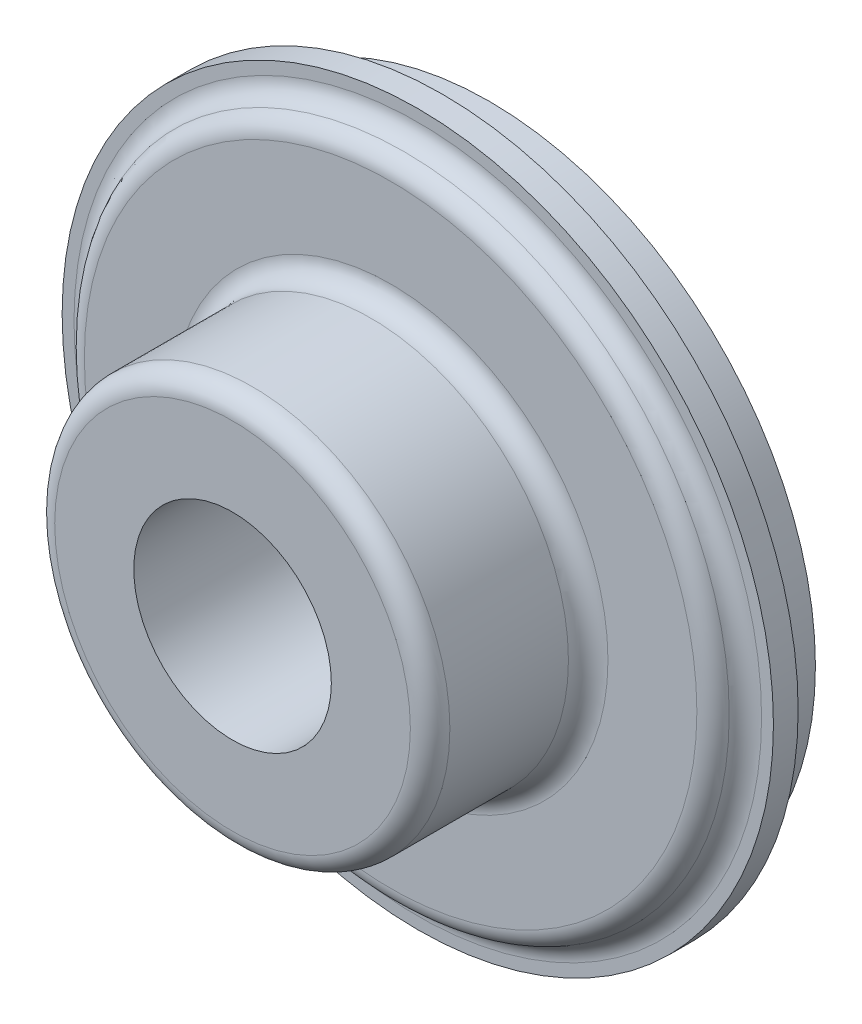
ISO-10303-21;
HEADER;
FILE_DESCRIPTION(('STEP AP214'),'2;1');
FILE_NAME('part.step','',(''),(''),'','','');
FILE_SCHEMA(('AUTOMOTIVE_DESIGN { 1 0 10303 214 1 1 1 1 }'));
ENDSEC;
DATA;
#1=APPLICATION_CONTEXT('core data for automotive mechanical design processes');
#2=APPLICATION_PROTOCOL_DEFINITION('international standard','automotive_design',2000,#1);
#3=PRODUCT_CONTEXT('',#1,'mechanical');
#4=PRODUCT('Part','Part','',(#3));
#5=PRODUCT_RELATED_PRODUCT_CATEGORY('part','',(#4));
#6=PRODUCT_DEFINITION_FORMATION('','',#4);
#7=PRODUCT_DEFINITION_CONTEXT('part definition',#1,'design');
#8=PRODUCT_DEFINITION('design','',#6,#7);
#9=PRODUCT_DEFINITION_SHAPE('','',#8);
#10=(LENGTH_UNIT() NAMED_UNIT(*) SI_UNIT(.MILLI.,.METRE.));
#11=(NAMED_UNIT(*) PLANE_ANGLE_UNIT() SI_UNIT($,.RADIAN.));
#12=(NAMED_UNIT(*) SI_UNIT($,.STERADIAN.) SOLID_ANGLE_UNIT());
#13=UNCERTAINTY_MEASURE_WITH_UNIT(LENGTH_MEASURE(1.E-05),#10,'distance_accuracy_value','');
#14=(GEOMETRIC_REPRESENTATION_CONTEXT(3) GLOBAL_UNCERTAINTY_ASSIGNED_CONTEXT((#13)) GLOBAL_UNIT_ASSIGNED_CONTEXT((#10,
#11,#12)) REPRESENTATION_CONTEXT('',''));
#15=CARTESIAN_POINT('',(0.,0.,0.));
#16=DIRECTION('',(0.,0.,1.));
#17=DIRECTION('',(1.,0.,0.));
#18=AXIS2_PLACEMENT_3D('',#15,#16,#17);
#19=CARTESIAN_POINT('',(0.,0.,229.));
#20=DIRECTION('',(0.,0.,1.));
#21=DIRECTION('',(1.,0.,0.));
#22=AXIS2_PLACEMENT_3D('',#19,#20,#21);
#23=TOROIDAL_SURFACE('',#22,22.,2.);
#24=CARTESIAN_POINT('',(0.,0.,227.));
#25=DIRECTION('',(0.,0.,1.));
#26=DIRECTION('',(1.,0.,0.));
#27=AXIS2_PLACEMENT_3D('',#24,#25,#26);
#28=CIRCLE('',#27,22.);
#29=CARTESIAN_POINT('',(22.,0.,227.));
#30=VERTEX_POINT('',#29);
#31=EDGE_CURVE('E128',#30,#30,#28,.T.);
#32=ORIENTED_EDGE('',*,*,#31,.T.);
#33=EDGE_LOOP('',(#32));
#34=FACE_BOUND('',#33,.T.);
#35=CARTESIAN_POINT('',(0.,0.,229.));
#36=DIRECTION('',(0.,0.,1.));
#37=DIRECTION('',(1.,0.,0.));
#38=AXIS2_PLACEMENT_3D('',#35,#36,#37);
#39=CIRCLE('',#38,20.);
#40=CARTESIAN_POINT('',(20.,0.,229.));
#41=VERTEX_POINT('',#40);
#42=EDGE_CURVE('E10',#41,#41,#39,.T.);
#43=ORIENTED_EDGE('',*,*,#42,.F.);
#44=EDGE_LOOP('',(#43));
#45=FACE_BOUND('',#44,.T.);
#46=ADVANCED_FACE('F41',(#34,#45),#23,.F.);
#47=CARTESIAN_POINT('',(0.,0.,208.));
#48=DIRECTION('',(0.,0.,1.));
#49=DIRECTION('',(1.,0.,0.));
#50=AXIS2_PLACEMENT_3D('',#47,#48,#49);
#51=CYLINDRICAL_SURFACE('',#50,20.);
#52=ORIENTED_EDGE('',*,*,#42,.T.);
#53=EDGE_LOOP('',(#52));
#54=FACE_BOUND('',#53,.T.);
#55=CARTESIAN_POINT('',(0.,0.,241.));
#56=DIRECTION('',(0.,0.,1.));
#57=DIRECTION('',(1.,0.,0.));
#58=AXIS2_PLACEMENT_3D('',#55,#56,#57);
#59=CIRCLE('',#58,20.);
#60=CARTESIAN_POINT('',(20.,0.,241.));
#61=VERTEX_POINT('',#60);
#62=EDGE_CURVE('E48',#61,#61,#59,.T.);
#63=ORIENTED_EDGE('',*,*,#62,.F.);
#64=EDGE_LOOP('',(#63));
#65=FACE_BOUND('',#64,.T.);
#66=ADVANCED_FACE('F147',(#54,#65),#51,.T.);
#67=CARTESIAN_POINT('',(0.,0.,241.));
#68=DIRECTION('',(0.,0.,1.));
#69=DIRECTION('',(1.,0.,0.));
#70=AXIS2_PLACEMENT_3D('',#67,#68,#69);
#71=TOROIDAL_SURFACE('',#70,18.,2.);
#72=ORIENTED_EDGE('',*,*,#62,.T.);
#73=EDGE_LOOP('',(#72));
#74=FACE_BOUND('',#73,.T.);
#75=CARTESIAN_POINT('',(0.,0.,243.));
#76=DIRECTION('',(0.,0.,1.));
#77=DIRECTION('',(1.,0.,0.));
#78=AXIS2_PLACEMENT_3D('',#75,#76,#77);
#79=CIRCLE('',#78,18.);
#80=CARTESIAN_POINT('',(18.,0.,243.));
#81=VERTEX_POINT('',#80);
#82=EDGE_CURVE('E53',#81,#81,#79,.T.);
#83=ORIENTED_EDGE('',*,*,#82,.F.);
#84=EDGE_LOOP('',(#83));
#85=FACE_BOUND('',#84,.T.);
#86=ADVANCED_FACE('F151',(#74,#85),#71,.T.);
#87=CARTESIAN_POINT('',(10.,0.,243.));
#88=DIRECTION('',(0.,0.,1.));
#89=DIRECTION('',(1.,0.,0.));
#90=AXIS2_PLACEMENT_3D('',#87,#88,#89);
#91=PLANE('',#90);
#92=ORIENTED_EDGE('',*,*,#82,.T.);
#93=EDGE_LOOP('',(#92));
#94=FACE_BOUND('',#93,.T.);
#95=CARTESIAN_POINT('',(0.,0.,243.));
#96=DIRECTION('',(0.,0.,1.));
#97=DIRECTION('',(1.,0.,0.));
#98=AXIS2_PLACEMENT_3D('',#95,#96,#97);
#99=CIRCLE('',#98,10.);
#100=CARTESIAN_POINT('',(10.,0.,243.));
#101=VERTEX_POINT('',#100);
#102=EDGE_CURVE('E58',#101,#101,#99,.T.);
#103=ORIENTED_EDGE('',*,*,#102,.F.);
#104=EDGE_LOOP('',(#103));
#105=FACE_BOUND('',#104,.T.);
#106=ADVANCED_FACE('F155',(#94,#105),#91,.T.);
#107=CARTESIAN_POINT('',(0.,0.,208.));
#108=DIRECTION('',(0.,0.,1.));
#109=DIRECTION('',(1.,0.,0.));
#110=AXIS2_PLACEMENT_3D('',#107,#108,#109);
#111=CYLINDRICAL_SURFACE('',#110,10.);
#112=ORIENTED_EDGE('',*,*,#102,.T.);
#113=EDGE_LOOP('',(#112));
#114=FACE_BOUND('',#113,.T.);
#115=CARTESIAN_POINT('',(0.,0.,210.));
#116=DIRECTION('',(0.,0.,1.));
#117=DIRECTION('',(1.,0.,0.));
#118=AXIS2_PLACEMENT_3D('',#115,#116,#117);
#119=CIRCLE('',#118,10.);
#120=CARTESIAN_POINT('',(10.,0.,210.));
#121=VERTEX_POINT('',#120);
#122=EDGE_CURVE('E64',#121,#121,#119,.T.);
#123=ORIENTED_EDGE('',*,*,#122,.F.);
#124=EDGE_LOOP('',(#123));
#125=FACE_BOUND('',#124,.T.);
#126=ADVANCED_FACE('F161',(#114,#125),#111,.F.);
#127=CARTESIAN_POINT('',(0.,0.,210.));
#128=DIRECTION('',(0.,0.,1.));
#129=DIRECTION('',(1.,0.,0.));
#130=AXIS2_PLACEMENT_3D('',#127,#128,#129);
#131=TOROIDAL_SURFACE('',#130,12.,2.);
#132=ORIENTED_EDGE('',*,*,#122,.T.);
#133=EDGE_LOOP('',(#132));
#134=FACE_BOUND('',#133,.T.);
#135=CARTESIAN_POINT('',(0.,0.,208.));
#136=DIRECTION('',(0.,0.,1.));
#137=DIRECTION('',(1.,0.,0.));
#138=AXIS2_PLACEMENT_3D('',#135,#136,#137);
#139=CIRCLE('',#138,12.);
#140=CARTESIAN_POINT('',(12.,0.,208.));
#141=VERTEX_POINT('',#140);
#142=EDGE_CURVE('E68',#141,#141,#139,.T.);
#143=ORIENTED_EDGE('',*,*,#142,.F.);
#144=EDGE_LOOP('',(#143));
#145=FACE_BOUND('',#144,.T.);
#146=ADVANCED_FACE('F165',(#134,#145),#131,.T.);
#147=CARTESIAN_POINT('',(16.7797337522496,0.,208.));
#148=DIRECTION('',(0.,0.,-1.));
#149=DIRECTION('',(-1.,0.,0.));
#150=AXIS2_PLACEMENT_3D('',#147,#148,#149);
#151=PLANE('',#150);
#152=ORIENTED_EDGE('',*,*,#142,.T.);
#153=EDGE_LOOP('',(#152));
#154=FACE_BOUND('',#153,.T.);
#155=CARTESIAN_POINT('',(0.,0.,208.));
#156=DIRECTION('',(0.,0.,1.));
#157=DIRECTION('',(1.,0.,0.));
#158=AXIS2_PLACEMENT_3D('',#155,#156,#157);
#159=CIRCLE('',#158,16.7797337522496);
#160=CARTESIAN_POINT('',(16.7797337522496,0.,208.));
#161=VERTEX_POINT('',#160);
#162=EDGE_CURVE('E72',#161,#161,#159,.T.);
#163=ORIENTED_EDGE('',*,*,#162,.F.);
#164=EDGE_LOOP('',(#163));
#165=FACE_BOUND('',#164,.T.);
#166=ADVANCED_FACE('F169',(#154,#165),#151,.T.);
#167=CARTESIAN_POINT('',(0.,0.,210.));
#168=DIRECTION('',(0.,0.,1.));
#169=DIRECTION('',(1.,0.,0.));
#170=AXIS2_PLACEMENT_3D('',#167,#168,#169);
#171=TOROIDAL_SURFACE('',#170,16.7797337522496,2.00000000000002);
#172=ORIENTED_EDGE('',*,*,#162,.T.);
#173=EDGE_LOOP('',(#172));
#174=FACE_BOUND('',#173,.T.);
#175=CARTESIAN_POINT('',(0.,0.,209.315959713348));
#176=DIRECTION('',(0.,0.,1.));
#177=DIRECTION('',(1.,0.,0.));
#178=AXIS2_PLACEMENT_3D('',#175,#176,#177);
#179=CIRCLE('',#178,18.6591189938214);
#180=CARTESIAN_POINT('',(18.6591189938214,0.,209.315959713348));
#181=VERTEX_POINT('',#180);
#182=EDGE_CURVE('E76',#181,#181,#179,.T.);
#183=ORIENTED_EDGE('',*,*,#182,.F.);
#184=EDGE_LOOP('',(#183));
#185=FACE_BOUND('',#184,.T.);
#186=ADVANCED_FACE('F173',(#174,#185),#171,.T.);
#187=CARTESIAN_POINT('',(0.,0.,213.));
#188=DIRECTION('',(0.,0.,1.));
#189=DIRECTION('',(1.,0.,0.));
#190=AXIS2_PLACEMENT_3D('',#187,#188,#189);
#191=CONICAL_SURFACE('',#190,20.,0.34906585039886);
#192=ORIENTED_EDGE('',*,*,#182,.T.);
#193=EDGE_LOOP('',(#192));
#194=FACE_BOUND('',#193,.T.);
#195=CARTESIAN_POINT('',(0.,0.,213.));
#196=DIRECTION('',(0.,0.,1.));
#197=DIRECTION('',(1.,0.,0.));
#198=AXIS2_PLACEMENT_3D('',#195,#196,#197);
#199=CIRCLE('',#198,20.);
#200=CARTESIAN_POINT('',(20.,0.,213.));
#201=VERTEX_POINT('',#200);
#202=EDGE_CURVE('E80',#201,#201,#199,.T.);
#203=ORIENTED_EDGE('',*,*,#202,.F.);
#204=EDGE_LOOP('',(#203));
#205=FACE_BOUND('',#204,.T.);
#206=ADVANCED_FACE('F177',(#194,#205),#191,.T.);
#207=CARTESIAN_POINT('',(0.,0.,208.));
#208=DIRECTION('',(0.,0.,1.));
#209=DIRECTION('',(1.,0.,0.));
#210=AXIS2_PLACEMENT_3D('',#207,#208,#209);
#211=CYLINDRICAL_SURFACE('',#210,20.);
#212=ORIENTED_EDGE('',*,*,#202,.T.);
#213=EDGE_LOOP('',(#212));
#214=FACE_BOUND('',#213,.T.);
#215=CARTESIAN_POINT('',(0.,0.,218.));
#216=DIRECTION('',(0.,0.,1.));
#217=DIRECTION('',(1.,0.,0.));
#218=AXIS2_PLACEMENT_3D('',#215,#216,#217);
#219=CIRCLE('',#218,20.);
#220=CARTESIAN_POINT('',(20.,0.,218.));
#221=VERTEX_POINT('',#220);
#222=EDGE_CURVE('E84',#221,#221,#219,.T.);
#223=ORIENTED_EDGE('',*,*,#222,.F.);
#224=EDGE_LOOP('',(#223));
#225=FACE_BOUND('',#224,.T.);
#226=ADVANCED_FACE('F181',(#214,#225),#211,.T.);
#227=CARTESIAN_POINT('',(0.,0.,223.));
#228=DIRECTION('',(0.,0.,1.));
#229=DIRECTION('',(1.,0.,0.));
#230=AXIS2_PLACEMENT_3D('',#227,#228,#229);
#231=CONICAL_SURFACE('',#230,21.819851171331,0.349065850398863);
#232=ORIENTED_EDGE('',*,*,#222,.T.);
#233=EDGE_LOOP('',(#232));
#234=FACE_BOUND('',#233,.T.);
#235=CARTESIAN_POINT('',(0.,0.,223.));
#236=DIRECTION('',(0.,0.,1.));
#237=DIRECTION('',(1.,0.,0.));
#238=AXIS2_PLACEMENT_3D('',#235,#236,#237);
#239=CIRCLE('',#238,21.819851171331);
#240=CARTESIAN_POINT('',(21.819851171331,0.,223.));
#241=VERTEX_POINT('',#240);
#242=EDGE_CURVE('E88',#241,#241,#239,.T.);
#243=ORIENTED_EDGE('',*,*,#242,.F.);
#244=EDGE_LOOP('',(#243));
#245=FACE_BOUND('',#244,.T.);
#246=ADVANCED_FACE('F185',(#234,#245),#231,.T.);
#247=CARTESIAN_POINT('',(27.,0.,223.));
#248=DIRECTION('',(0.,0.,-1.));
#249=DIRECTION('',(-1.,0.,0.));
#250=AXIS2_PLACEMENT_3D('',#247,#248,#249);
#251=PLANE('',#250);
#252=ORIENTED_EDGE('',*,*,#242,.T.);
#253=EDGE_LOOP('',(#252));
#254=FACE_BOUND('',#253,.T.);
#255=CARTESIAN_POINT('',(0.,0.,223.));
#256=DIRECTION('',(0.,0.,1.));
#257=DIRECTION('',(1.,0.,0.));
#258=AXIS2_PLACEMENT_3D('',#255,#256,#257);
#259=CIRCLE('',#258,27.);
#260=CARTESIAN_POINT('',(27.,0.,223.));
#261=VERTEX_POINT('',#260);
#262=EDGE_CURVE('E92',#261,#261,#259,.T.);
#263=ORIENTED_EDGE('',*,*,#262,.F.);
#264=EDGE_LOOP('',(#263));
#265=FACE_BOUND('',#264,.T.);
#266=ADVANCED_FACE('F189',(#254,#265),#251,.T.);
#267=CARTESIAN_POINT('',(0.,0.,208.));
#268=DIRECTION('',(0.,0.,1.));
#269=DIRECTION('',(1.,0.,0.));
#270=AXIS2_PLACEMENT_3D('',#267,#268,#269);
#271=CYLINDRICAL_SURFACE('',#270,27.);
#272=ORIENTED_EDGE('',*,*,#262,.T.);
#273=EDGE_LOOP('',(#272));
#274=FACE_BOUND('',#273,.T.);
#275=CARTESIAN_POINT('',(0.,0.,217.));
#276=DIRECTION('',(0.,0.,1.));
#277=DIRECTION('',(1.,0.,0.));
#278=AXIS2_PLACEMENT_3D('',#275,#276,#277);
#279=CIRCLE('',#278,27.);
#280=CARTESIAN_POINT('',(27.,0.,217.));
#281=VERTEX_POINT('',#280);
#282=EDGE_CURVE('E96',#281,#281,#279,.T.);
#283=ORIENTED_EDGE('',*,*,#282,.F.);
#284=EDGE_LOOP('',(#283));
#285=FACE_BOUND('',#284,.T.);
#286=ADVANCED_FACE('F193',(#274,#285),#271,.F.);
#287=CARTESIAN_POINT('',(33.,0.,217.));
#288=DIRECTION('',(0.,0.,-1.));
#289=DIRECTION('',(-1.,0.,0.));
#290=AXIS2_PLACEMENT_3D('',#287,#288,#289);
#291=PLANE('',#290);
#292=ORIENTED_EDGE('',*,*,#282,.T.);
#293=EDGE_LOOP('',(#292));
#294=FACE_BOUND('',#293,.T.);
#295=CARTESIAN_POINT('',(0.,0.,217.));
#296=DIRECTION('',(0.,0.,1.));
#297=DIRECTION('',(1.,0.,0.));
#298=AXIS2_PLACEMENT_3D('',#295,#296,#297);
#299=CIRCLE('',#298,33.);
#300=CARTESIAN_POINT('',(33.,0.,217.));
#301=VERTEX_POINT('',#300);
#302=EDGE_CURVE('E100',#301,#301,#299,.T.);
#303=ORIENTED_EDGE('',*,*,#302,.F.);
#304=EDGE_LOOP('',(#303));
#305=FACE_BOUND('',#304,.T.);
#306=ADVANCED_FACE('F197',(#294,#305),#291,.T.);
#307=CARTESIAN_POINT('',(0.,0.,208.));
#308=DIRECTION('',(0.,0.,1.));
#309=DIRECTION('',(1.,0.,0.));
#310=AXIS2_PLACEMENT_3D('',#307,#308,#309);
#311=CYLINDRICAL_SURFACE('',#310,33.);
#312=ORIENTED_EDGE('',*,*,#302,.T.);
#313=EDGE_LOOP('',(#312));
#314=FACE_BOUND('',#313,.T.);
#315=CARTESIAN_POINT('',(0.,0.,221.75));
#316=DIRECTION('',(0.,0.,1.));
#317=DIRECTION('',(1.,0.,0.));
#318=AXIS2_PLACEMENT_3D('',#315,#316,#317);
#319=CIRCLE('',#318,33.);
#320=CARTESIAN_POINT('',(33.,0.,221.75));
#321=VERTEX_POINT('',#320);
#322=EDGE_CURVE('E104',#321,#321,#319,.T.);
#323=ORIENTED_EDGE('',*,*,#322,.F.);
#324=EDGE_LOOP('',(#323));
#325=FACE_BOUND('',#324,.T.);
#326=ADVANCED_FACE('F201',(#314,#325),#311,.T.);
#327=CARTESIAN_POINT('',(36.,0.,221.75));
#328=DIRECTION('',(0.,0.,-1.));
#329=DIRECTION('',(-1.,0.,0.));
#330=AXIS2_PLACEMENT_3D('',#327,#328,#329);
#331=PLANE('',#330);
#332=ORIENTED_EDGE('',*,*,#322,.T.);
#333=EDGE_LOOP('',(#332));
#334=FACE_BOUND('',#333,.T.);
#335=CARTESIAN_POINT('',(0.,0.,221.75));
#336=DIRECTION('',(0.,0.,1.));
#337=DIRECTION('',(1.,0.,0.));
#338=AXIS2_PLACEMENT_3D('',#335,#336,#337);
#339=CIRCLE('',#338,36.);
#340=CARTESIAN_POINT('',(36.,0.,221.75));
#341=VERTEX_POINT('',#340);
#342=EDGE_CURVE('E108',#341,#341,#339,.T.);
#343=ORIENTED_EDGE('',*,*,#342,.F.);
#344=EDGE_LOOP('',(#343));
#345=FACE_BOUND('',#344,.T.);
#346=ADVANCED_FACE('F205',(#334,#345),#331,.T.);
#347=CARTESIAN_POINT('',(0.,0.,208.));
#348=DIRECTION('',(0.,0.,1.));
#349=DIRECTION('',(1.,0.,0.));
#350=AXIS2_PLACEMENT_3D('',#347,#348,#349);
#351=CYLINDRICAL_SURFACE('',#350,36.);
#352=ORIENTED_EDGE('',*,*,#342,.T.);
#353=EDGE_LOOP('',(#352));
#354=FACE_BOUND('',#353,.T.);
#355=CARTESIAN_POINT('',(0.,0.,224.25));
#356=DIRECTION('',(0.,0.,1.));
#357=DIRECTION('',(1.,0.,0.));
#358=AXIS2_PLACEMENT_3D('',#355,#356,#357);
#359=CIRCLE('',#358,36.);
#360=CARTESIAN_POINT('',(36.,0.,224.25));
#361=VERTEX_POINT('',#360);
#362=EDGE_CURVE('E112',#361,#361,#359,.T.);
#363=ORIENTED_EDGE('',*,*,#362,.F.);
#364=EDGE_LOOP('',(#363));
#365=FACE_BOUND('',#364,.T.);
#366=ADVANCED_FACE('F209',(#354,#365),#351,.T.);
#367=CARTESIAN_POINT('',(34.7996710383926,0.,224.25));
#368=DIRECTION('',(0.,0.,1.));
#369=DIRECTION('',(1.,0.,0.));
#370=AXIS2_PLACEMENT_3D('',#367,#368,#369);
#371=PLANE('',#370);
#372=ORIENTED_EDGE('',*,*,#362,.T.);
#373=EDGE_LOOP('',(#372));
#374=FACE_BOUND('',#373,.T.);
#375=CARTESIAN_POINT('',(0.,0.,224.25));
#376=DIRECTION('',(0.,0.,1.));
#377=DIRECTION('',(1.,0.,0.));
#378=AXIS2_PLACEMENT_3D('',#375,#376,#377);
#379=CIRCLE('',#378,34.7996710383926);
#380=CARTESIAN_POINT('',(34.7996710383926,0.,224.25));
#381=VERTEX_POINT('',#380);
#382=EDGE_CURVE('E116',#381,#381,#379,.T.);
#383=ORIENTED_EDGE('',*,*,#382,.F.);
#384=EDGE_LOOP('',(#383));
#385=FACE_BOUND('',#384,.T.);
#386=ADVANCED_FACE('F213',(#374,#385),#371,.T.);
#387=CARTESIAN_POINT('',(0.,0.,226.25));
#388=DIRECTION('',(0.,0.,1.));
#389=DIRECTION('',(1.,0.,0.));
#390=AXIS2_PLACEMENT_3D('',#387,#388,#389);
#391=TOROIDAL_SURFACE('',#390,34.7996710383926,1.99999999999998);
#392=ORIENTED_EDGE('',*,*,#382,.T.);
#393=EDGE_LOOP('',(#392));
#394=FACE_BOUND('',#393,.T.);
#395=CARTESIAN_POINT('',(0.,0.,225.625));
#396=DIRECTION('',(0.,0.,1.));
#397=DIRECTION('',(1.,0.,0.));
#398=AXIS2_PLACEMENT_3D('',#395,#396,#397);
#399=CIRCLE('',#398,32.8998355191964);
#400=CARTESIAN_POINT('',(32.8998355191964,0.,225.625));
#401=VERTEX_POINT('',#400);
#402=EDGE_CURVE('E120',#401,#401,#399,.T.);
#403=ORIENTED_EDGE('',*,*,#402,.F.);
#404=EDGE_LOOP('',(#403));
#405=FACE_BOUND('',#404,.T.);
#406=ADVANCED_FACE('F143',(#394,#405),#391,.F.);
#407=CARTESIAN_POINT('',(0.,0.,225.));
#408=DIRECTION('',(0.,0.,1.));
#409=DIRECTION('',(1.,0.,0.));
#410=AXIS2_PLACEMENT_3D('',#407,#408,#409);
#411=TOROIDAL_SURFACE('',#410,31.,2.00000000000001);
#412=ORIENTED_EDGE('',*,*,#402,.T.);
#413=EDGE_LOOP('',(#412));
#414=FACE_BOUND('',#413,.T.);
#415=CARTESIAN_POINT('',(0.,0.,227.));
#416=DIRECTION('',(0.,0.,1.));
#417=DIRECTION('',(1.,0.,0.));
#418=AXIS2_PLACEMENT_3D('',#415,#416,#417);
#419=CIRCLE('',#418,31.);
#420=CARTESIAN_POINT('',(31.,0.,227.));
#421=VERTEX_POINT('',#420);
#422=EDGE_CURVE('E124',#421,#421,#419,.T.);
#423=ORIENTED_EDGE('',*,*,#422,.F.);
#424=EDGE_LOOP('',(#423));
#425=FACE_BOUND('',#424,.T.);
#426=ADVANCED_FACE('F137',(#414,#425),#411,.T.);
#427=CARTESIAN_POINT('',(22.,0.,227.));
#428=DIRECTION('',(0.,0.,1.));
#429=DIRECTION('',(1.,0.,0.));
#430=AXIS2_PLACEMENT_3D('',#427,#428,#429);
#431=PLANE('',#430);
#432=ORIENTED_EDGE('',*,*,#422,.T.);
#433=EDGE_LOOP('',(#432));
#434=FACE_BOUND('',#433,.T.);
#435=ORIENTED_EDGE('',*,*,#31,.F.);
#436=EDGE_LOOP('',(#435));
#437=FACE_BOUND('',#436,.T.);
#438=ADVANCED_FACE('F135',(#434,#437),#431,.T.);
#439=CLOSED_SHELL('',(#46,#66,#86,#106,#126,#146,#166,#186,#206,#226,#246,#266,#286,#306,#326,
#346,#366,#386,#406,#426,#438));
#440=MANIFOLD_SOLID_BREP('B2',#439);
#441=ADVANCED_BREP_SHAPE_REPRESENTATION('',(#18,#440),#14);
#442=SHAPE_DEFINITION_REPRESENTATION(#9,#441);
ENDSEC;
END-ISO-10303-21;
